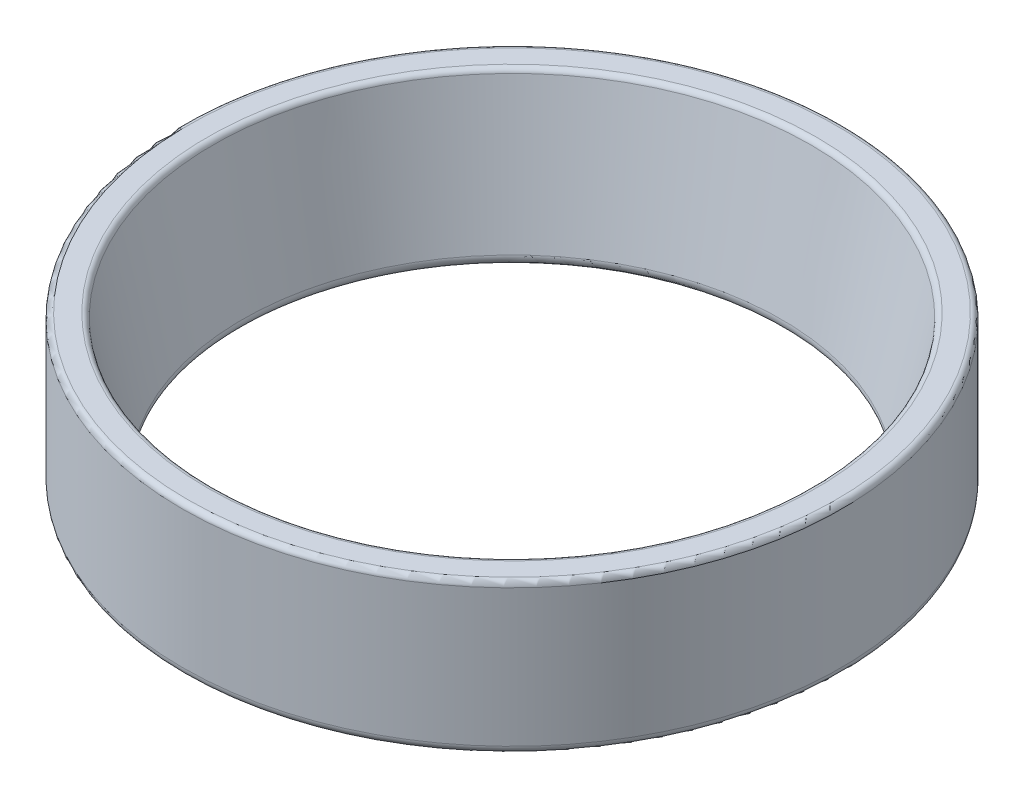
ISO-10303-21;
HEADER;
FILE_DESCRIPTION(('STEP AP214'),'2;1');
FILE_NAME('part.step','',(''),(''),'','','');
FILE_SCHEMA(('AUTOMOTIVE_DESIGN { 1 0 10303 214 1 1 1 1 }'));
ENDSEC;
DATA;
#1=APPLICATION_CONTEXT('core data for automotive mechanical design processes');
#2=APPLICATION_PROTOCOL_DEFINITION('international standard','automotive_design',2000,#1);
#3=PRODUCT_CONTEXT('',#1,'mechanical');
#4=PRODUCT('Part','Part','',(#3));
#5=PRODUCT_RELATED_PRODUCT_CATEGORY('part','',(#4));
#6=PRODUCT_DEFINITION_FORMATION('','',#4);
#7=PRODUCT_DEFINITION_CONTEXT('part definition',#1,'design');
#8=PRODUCT_DEFINITION('design','',#6,#7);
#9=PRODUCT_DEFINITION_SHAPE('','',#8);
#10=(LENGTH_UNIT() NAMED_UNIT(*) SI_UNIT(.MILLI.,.METRE.));
#11=(NAMED_UNIT(*) PLANE_ANGLE_UNIT() SI_UNIT($,.RADIAN.));
#12=(NAMED_UNIT(*) SI_UNIT($,.STERADIAN.) SOLID_ANGLE_UNIT());
#13=UNCERTAINTY_MEASURE_WITH_UNIT(LENGTH_MEASURE(1.E-05),#10,'distance_accuracy_value','');
#14=(GEOMETRIC_REPRESENTATION_CONTEXT(3) GLOBAL_UNCERTAINTY_ASSIGNED_CONTEXT((#13)) GLOBAL_UNIT_ASSIGNED_CONTEXT((#10,
#11,#12)) REPRESENTATION_CONTEXT('',''));
#15=CARTESIAN_POINT('',(0.,0.,0.));
#16=DIRECTION('',(0.,0.,1.));
#17=DIRECTION('',(1.,0.,0.));
#18=AXIS2_PLACEMENT_3D('',#15,#16,#17);
#19=CARTESIAN_POINT('',(0.,0.,0.));
#20=DIRECTION('',(0.,-1.,0.));
#21=DIRECTION('',(0.,0.,-1.));
#22=AXIS2_PLACEMENT_3D('',#19,#20,#21);
#23=CYLINDRICAL_SURFACE('',#22,30.5);
#24=CARTESIAN_POINT('',(0.,0.799999999999996,0.));
#25=DIRECTION('',(0.,1.,0.));
#26=DIRECTION('',(0.,0.,1.));
#27=AXIS2_PLACEMENT_3D('',#24,#25,#26);
#28=CIRCLE('',#27,30.5);
#29=CARTESIAN_POINT('',(0.,0.799999999999996,30.5));
#30=VERTEX_POINT('',#29);
#31=EDGE_CURVE('E10',#30,#30,#28,.T.);
#32=ORIENTED_EDGE('',*,*,#31,.T.);
#33=EDGE_LOOP('',(#32));
#34=FACE_BOUND('',#33,.T.);
#35=CARTESIAN_POINT('',(0.,13.5,0.));
#36=DIRECTION('',(0.,1.,0.));
#37=DIRECTION('',(0.,0.,1.));
#38=AXIS2_PLACEMENT_3D('',#35,#36,#37);
#39=CIRCLE('',#38,30.5);
#40=CARTESIAN_POINT('',(0.,13.5,30.5));
#41=VERTEX_POINT('',#40);
#42=EDGE_CURVE('E65',#41,#41,#39,.F.);
#43=ORIENTED_EDGE('',*,*,#42,.T.);
#44=EDGE_LOOP('',(#43));
#45=FACE_BOUND('',#44,.T.);
#46=ADVANCED_FACE('F36',(#34,#45),#23,.T.);
#47=CARTESIAN_POINT('',(-30.5,14.,0.));
#48=DIRECTION('',(0.,1.,0.));
#49=DIRECTION('',(0.,0.,1.));
#50=AXIS2_PLACEMENT_3D('',#47,#48,#49);
#51=PLANE('',#50);
#52=CARTESIAN_POINT('',(0.,14.,0.));
#53=DIRECTION('',(0.,1.,0.));
#54=DIRECTION('',(0.,0.,1.));
#55=AXIS2_PLACEMENT_3D('',#52,#53,#54);
#56=CIRCLE('',#55,30.);
#57=CARTESIAN_POINT('',(0.,14.,30.));
#58=VERTEX_POINT('',#57);
#59=EDGE_CURVE('E59',#58,#58,#56,.T.);
#60=ORIENTED_EDGE('',*,*,#59,.T.);
#61=EDGE_LOOP('',(#60));
#62=FACE_BOUND('',#61,.T.);
#63=CARTESIAN_POINT('',(0.,14.,0.));
#64=DIRECTION('',(0.,1.,0.));
#65=DIRECTION('',(0.,0.,1.));
#66=AXIS2_PLACEMENT_3D('',#63,#64,#65);
#67=CIRCLE('',#66,28.154207895117);
#68=CARTESIAN_POINT('',(0.,14.,28.154207895117));
#69=VERTEX_POINT('',#68);
#70=EDGE_CURVE('E62',#69,#69,#67,.F.);
#71=ORIENTED_EDGE('',*,*,#70,.T.);
#72=EDGE_LOOP('',(#71));
#73=FACE_BOUND('',#72,.T.);
#74=ADVANCED_FACE('F88',(#62,#73),#51,.T.);
#75=CARTESIAN_POINT('',(0.,14.,0.));
#76=DIRECTION('',(0.,1.,0.));
#77=DIRECTION('',(0.,0.,1.));
#78=AXIS2_PLACEMENT_3D('',#75,#76,#77);
#79=CONICAL_SURFACE('',#78,27.75,0.211093333222746);
#80=CARTESIAN_POINT('',(0.,0.967623270984696,0.));
#81=DIRECTION('',(0.,1.,0.));
#82=DIRECTION('',(0.,0.,1.));
#83=AXIS2_PLACEMENT_3D('',#80,#81,#82);
#84=CIRCLE('',#83,24.9573478437824);
#85=CARTESIAN_POINT('',(0.,0.967623270984696,24.9573478437824));
#86=VERTEX_POINT('',#85);
#87=EDGE_CURVE('E51',#86,#86,#84,.F.);
#88=ORIENTED_EDGE('',*,*,#87,.T.);
#89=EDGE_LOOP('',(#88));
#90=FACE_BOUND('',#89,.T.);
#91=CARTESIAN_POINT('',(0.,13.6047645443655,0.));
#92=DIRECTION('',(0.,-1.,0.));
#93=DIRECTION('',(0.,0.,-1.));
#94=AXIS2_PLACEMENT_3D('',#91,#92,#93);
#95=CIRCLE('',#94,27.6653066880783);
#96=CARTESIAN_POINT('',(0.,13.6047645443655,-27.6653066880783));
#97=VERTEX_POINT('',#96);
#98=EDGE_CURVE('E56',#97,#97,#95,.F.);
#99=ORIENTED_EDGE('',*,*,#98,.T.);
#100=EDGE_LOOP('',(#99));
#101=FACE_BOUND('',#100,.T.);
#102=ADVANCED_FACE('F83',(#90,#101),#79,.F.);
#103=CARTESIAN_POINT('',(-30.5,0.,0.));
#104=DIRECTION('',(0.,1.,0.));
#105=DIRECTION('',(0.,0.,1.));
#106=AXIS2_PLACEMENT_3D('',#103,#104,#105);
#107=PLANE('',#106);
#108=CARTESIAN_POINT('',(0.,0.,0.));
#109=DIRECTION('',(0.,1.,0.));
#110=DIRECTION('',(0.,0.,1.));
#111=AXIS2_PLACEMENT_3D('',#108,#109,#110);
#112=CIRCLE('',#111,25.7395897750444);
#113=CARTESIAN_POINT('',(0.,0.,25.7395897750444));
#114=VERTEX_POINT('',#113);
#115=EDGE_CURVE('E43',#114,#114,#112,.T.);
#116=ORIENTED_EDGE('',*,*,#115,.T.);
#117=EDGE_LOOP('',(#116));
#118=FACE_BOUND('',#117,.T.);
#119=CARTESIAN_POINT('',(0.,0.,0.));
#120=DIRECTION('',(0.,1.,0.));
#121=DIRECTION('',(0.,0.,1.));
#122=AXIS2_PLACEMENT_3D('',#119,#120,#121);
#123=CIRCLE('',#122,29.7);
#124=CARTESIAN_POINT('',(0.,0.,29.7));
#125=VERTEX_POINT('',#124);
#126=EDGE_CURVE('E47',#125,#125,#123,.F.);
#127=ORIENTED_EDGE('',*,*,#126,.T.);
#128=EDGE_LOOP('',(#127));
#129=FACE_BOUND('',#128,.T.);
#130=ADVANCED_FACE('F73',(#118,#129),#107,.F.);
#131=CARTESIAN_POINT('',(0.,13.5,0.));
#132=DIRECTION('',(0.,1.,0.));
#133=DIRECTION('',(0.,0.,1.));
#134=AXIS2_PLACEMENT_3D('',#131,#132,#133);
#135=TOROIDAL_SURFACE('',#134,30.,0.5);
#136=ORIENTED_EDGE('',*,*,#59,.F.);
#137=EDGE_LOOP('',(#136));
#138=FACE_BOUND('',#137,.T.);
#139=ORIENTED_EDGE('',*,*,#42,.F.);
#140=EDGE_LOOP('',(#139));
#141=FACE_BOUND('',#140,.T.);
#142=ADVANCED_FACE('F70',(#138,#141),#135,.T.);
#143=CARTESIAN_POINT('',(0.,13.5,0.));
#144=DIRECTION('',(0.,1.,0.));
#145=DIRECTION('',(0.,0.,1.));
#146=AXIS2_PLACEMENT_3D('',#143,#144,#145);
#147=TOROIDAL_SURFACE('',#146,28.154207895117,0.5);
#148=ORIENTED_EDGE('',*,*,#98,.F.);
#149=EDGE_LOOP('',(#148));
#150=FACE_BOUND('',#149,.T.);
#151=ORIENTED_EDGE('',*,*,#70,.F.);
#152=EDGE_LOOP('',(#151));
#153=FACE_BOUND('',#152,.T.);
#154=ADVANCED_FACE('F72',(#150,#153),#147,.T.);
#155=CARTESIAN_POINT('',(0.,0.799999999999997,0.));
#156=DIRECTION('',(0.,1.,0.));
#157=DIRECTION('',(0.,0.,1.));
#158=AXIS2_PLACEMENT_3D('',#155,#156,#157);
#159=TOROIDAL_SURFACE('',#158,25.7395897750444,0.8);
#160=ORIENTED_EDGE('',*,*,#115,.F.);
#161=EDGE_LOOP('',(#160));
#162=FACE_BOUND('',#161,.T.);
#163=ORIENTED_EDGE('',*,*,#87,.F.);
#164=EDGE_LOOP('',(#163));
#165=FACE_BOUND('',#164,.T.);
#166=ADVANCED_FACE('F80',(#162,#165),#159,.T.);
#167=CARTESIAN_POINT('',(0.,0.799999999999996,0.));
#168=DIRECTION('',(0.,1.,0.));
#169=DIRECTION('',(0.,0.,1.));
#170=AXIS2_PLACEMENT_3D('',#167,#168,#169);
#171=TOROIDAL_SURFACE('',#170,29.7,0.8);
#172=ORIENTED_EDGE('',*,*,#31,.F.);
#173=EDGE_LOOP('',(#172));
#174=FACE_BOUND('',#173,.T.);
#175=ORIENTED_EDGE('',*,*,#126,.F.);
#176=EDGE_LOOP('',(#175));
#177=FACE_BOUND('',#176,.T.);
#178=ADVANCED_FACE('F38',(#174,#177),#171,.T.);
#179=CLOSED_SHELL('',(#46,#74,#102,#130,#142,#154,#166,#178));
#180=MANIFOLD_SOLID_BREP('B2',#179);
#181=ADVANCED_BREP_SHAPE_REPRESENTATION('',(#18,#180),#14);
#182=SHAPE_DEFINITION_REPRESENTATION(#9,#181);
ENDSEC;
END-ISO-10303-21;
